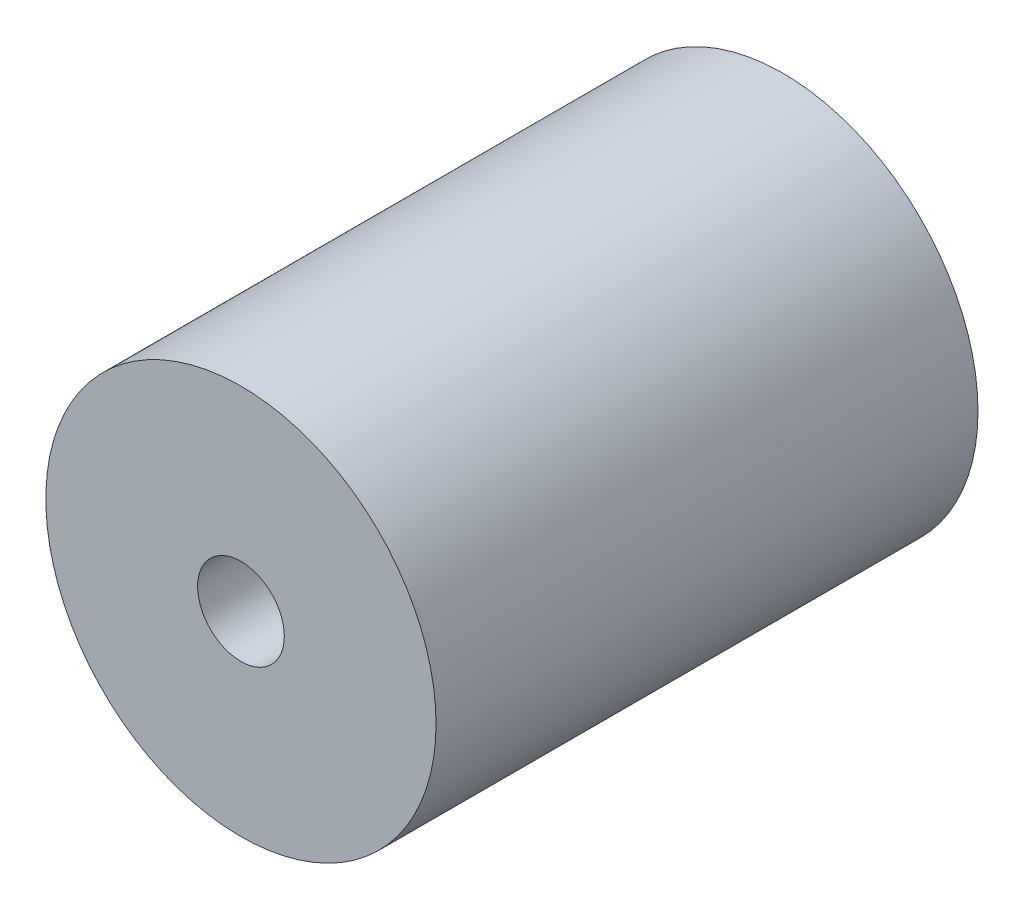
ISO-10303-21;
HEADER;
FILE_DESCRIPTION(('STEP AP214'),'2;1');
FILE_NAME('part.step','',(''),(''),'','','');
FILE_SCHEMA(('AUTOMOTIVE_DESIGN { 1 0 10303 214 1 1 1 1 }'));
ENDSEC;
DATA;
#1=APPLICATION_CONTEXT('core data for automotive mechanical design processes');
#2=APPLICATION_PROTOCOL_DEFINITION('international standard','automotive_design',2000,#1);
#3=PRODUCT_CONTEXT('',#1,'mechanical');
#4=PRODUCT('Part','Part','',(#3));
#5=PRODUCT_RELATED_PRODUCT_CATEGORY('part','',(#4));
#6=PRODUCT_DEFINITION_FORMATION('','',#4);
#7=PRODUCT_DEFINITION_CONTEXT('part definition',#1,'design');
#8=PRODUCT_DEFINITION('design','',#6,#7);
#9=PRODUCT_DEFINITION_SHAPE('','',#8);
#10=(LENGTH_UNIT() NAMED_UNIT(*) SI_UNIT(.MILLI.,.METRE.));
#11=(NAMED_UNIT(*) PLANE_ANGLE_UNIT() SI_UNIT($,.RADIAN.));
#12=(NAMED_UNIT(*) SI_UNIT($,.STERADIAN.) SOLID_ANGLE_UNIT());
#13=UNCERTAINTY_MEASURE_WITH_UNIT(LENGTH_MEASURE(1.E-05),#10,'distance_accuracy_value','');
#14=(GEOMETRIC_REPRESENTATION_CONTEXT(3) GLOBAL_UNCERTAINTY_ASSIGNED_CONTEXT((#13)) GLOBAL_UNIT_ASSIGNED_CONTEXT((#10,
#11,#12)) REPRESENTATION_CONTEXT('',''));
#15=CARTESIAN_POINT('',(0.,0.,0.));
#16=DIRECTION('',(0.,0.,1.));
#17=DIRECTION('',(1.,0.,0.));
#18=AXIS2_PLACEMENT_3D('',#15,#16,#17);
#19=CARTESIAN_POINT('',(0.,0.,12.5));
#20=DIRECTION('',(0.,0.,-1.));
#21=DIRECTION('',(-1.,0.,0.));
#22=AXIS2_PLACEMENT_3D('',#19,#20,#21);
#23=CYLINDRICAL_SURFACE('',#22,9.);
#24=CARTESIAN_POINT('',(0.,0.,12.5));
#25=DIRECTION('',(0.,0.,1.));
#26=DIRECTION('',(1.,0.,0.));
#27=AXIS2_PLACEMENT_3D('',#24,#25,#26);
#28=CIRCLE('',#27,9.);
#29=CARTESIAN_POINT('',(9.,0.,12.5));
#30=VERTEX_POINT('',#29);
#31=EDGE_CURVE('E10',#30,#30,#28,.T.);
#32=ORIENTED_EDGE('',*,*,#31,.F.);
#33=EDGE_LOOP('',(#32));
#34=FACE_BOUND('',#33,.T.);
#35=CARTESIAN_POINT('',(0.,0.,-12.5));
#36=DIRECTION('',(0.,0.,1.));
#37=DIRECTION('',(1.,0.,0.));
#38=AXIS2_PLACEMENT_3D('',#35,#36,#37);
#39=CIRCLE('',#38,9.);
#40=CARTESIAN_POINT('',(9.,0.,-12.5));
#41=VERTEX_POINT('',#40);
#42=EDGE_CURVE('E38',#41,#41,#39,.T.);
#43=ORIENTED_EDGE('',*,*,#42,.T.);
#44=EDGE_LOOP('',(#43));
#45=FACE_BOUND('',#44,.T.);
#46=ADVANCED_FACE('F35',(#34,#45),#23,.T.);
#47=CARTESIAN_POINT('',(0.,0.,12.5));
#48=DIRECTION('',(0.,0.,1.));
#49=DIRECTION('',(1.,0.,0.));
#50=AXIS2_PLACEMENT_3D('',#47,#48,#49);
#51=PLANE('',#50);
#52=CARTESIAN_POINT('',(0.,0.,12.5));
#53=DIRECTION('',(0.,0.,1.));
#54=DIRECTION('',(1.,0.,0.));
#55=AXIS2_PLACEMENT_3D('',#52,#53,#54);
#56=CIRCLE('',#55,2.);
#57=CARTESIAN_POINT('',(2.,0.,12.5));
#58=VERTEX_POINT('',#57);
#59=EDGE_CURVE('E45',#58,#58,#56,.T.);
#60=ORIENTED_EDGE('',*,*,#59,.F.);
#61=EDGE_LOOP('',(#60));
#62=FACE_BOUND('',#61,.T.);
#63=ORIENTED_EDGE('',*,*,#31,.T.);
#64=EDGE_LOOP('',(#63));
#65=FACE_BOUND('',#64,.T.);
#66=ADVANCED_FACE('F66',(#62,#65),#51,.T.);
#67=CARTESIAN_POINT('',(0.,0.,-12.5));
#68=DIRECTION('',(0.,0.,1.));
#69=DIRECTION('',(1.,0.,0.));
#70=AXIS2_PLACEMENT_3D('',#67,#68,#69);
#71=PLANE('',#70);
#72=CARTESIAN_POINT('',(0.,0.,-12.5));
#73=DIRECTION('',(0.,0.,-1.));
#74=DIRECTION('',(-1.,0.,0.));
#75=AXIS2_PLACEMENT_3D('',#72,#73,#74);
#76=CIRCLE('',#75,4.);
#77=CARTESIAN_POINT('',(-4.,0.,-12.5));
#78=VERTEX_POINT('',#77);
#79=EDGE_CURVE('E55',#78,#78,#76,.T.);
#80=ORIENTED_EDGE('',*,*,#79,.F.);
#81=EDGE_LOOP('',(#80));
#82=FACE_BOUND('',#81,.T.);
#83=ORIENTED_EDGE('',*,*,#42,.F.);
#84=EDGE_LOOP('',(#83));
#85=FACE_BOUND('',#84,.T.);
#86=ADVANCED_FACE('F62',(#82,#85),#71,.F.);
#87=CARTESIAN_POINT('',(0.,0.,-5.65685424949238));
#88=DIRECTION('',(0.,0.,1.));
#89=DIRECTION('',(1.,0.,0.));
#90=AXIS2_PLACEMENT_3D('',#87,#88,#89);
#91=CYLINDRICAL_SURFACE('',#90,2.);
#92=CARTESIAN_POINT('',(0.,0.,0.));
#93=DIRECTION('',(0.,0.,1.));
#94=DIRECTION('',(1.,0.,0.));
#95=AXIS2_PLACEMENT_3D('',#92,#93,#94);
#96=CIRCLE('',#95,2.);
#97=CARTESIAN_POINT('',(2.,0.,0.));
#98=VERTEX_POINT('',#97);
#99=EDGE_CURVE('E47',#98,#98,#96,.F.);
#100=ORIENTED_EDGE('',*,*,#99,.T.);
#101=EDGE_LOOP('',(#100));
#102=FACE_BOUND('',#101,.T.);
#103=ORIENTED_EDGE('',*,*,#59,.T.);
#104=EDGE_LOOP('',(#103));
#105=FACE_BOUND('',#104,.T.);
#106=ADVANCED_FACE('F65',(#102,#105),#91,.F.);
#107=CARTESIAN_POINT('',(0.,0.,0.));
#108=DIRECTION('',(0.,0.,1.));
#109=DIRECTION('',(1.,0.,0.));
#110=AXIS2_PLACEMENT_3D('',#107,#108,#109);
#111=PLANE('',#110);
#112=CARTESIAN_POINT('',(0.,0.,0.));
#113=DIRECTION('',(0.,0.,1.));
#114=DIRECTION('',(1.,0.,0.));
#115=AXIS2_PLACEMENT_3D('',#112,#113,#114);
#116=CIRCLE('',#115,4.);
#117=CARTESIAN_POINT('',(4.,0.,0.));
#118=VERTEX_POINT('',#117);
#119=EDGE_CURVE('E50',#118,#118,#116,.F.);
#120=ORIENTED_EDGE('',*,*,#119,.T.);
#121=EDGE_LOOP('',(#120));
#122=FACE_BOUND('',#121,.T.);
#123=ORIENTED_EDGE('',*,*,#99,.F.);
#124=EDGE_LOOP('',(#123));
#125=FACE_BOUND('',#124,.T.);
#126=ADVANCED_FACE('F82',(#122,#125),#111,.F.);
#127=CARTESIAN_POINT('',(0.,0.,11.3137084989848));
#128=DIRECTION('',(0.,0.,-1.));
#129=DIRECTION('',(-1.,0.,0.));
#130=AXIS2_PLACEMENT_3D('',#127,#128,#129);
#131=CYLINDRICAL_SURFACE('',#130,4.);
#132=ORIENTED_EDGE('',*,*,#79,.T.);
#133=EDGE_LOOP('',(#132));
#134=FACE_BOUND('',#133,.T.);
#135=ORIENTED_EDGE('',*,*,#119,.F.);
#136=EDGE_LOOP('',(#135));
#137=FACE_BOUND('',#136,.T.);
#138=ADVANCED_FACE('F59',(#134,#137),#131,.F.);
#139=CLOSED_SHELL('',(#46,#66,#86,#106,#126,#138));
#140=MANIFOLD_SOLID_BREP('B2',#139);
#141=ADVANCED_BREP_SHAPE_REPRESENTATION('',(#18,#140),#14);
#142=SHAPE_DEFINITION_REPRESENTATION(#9,#141);
ENDSEC;
END-ISO-10303-21;
